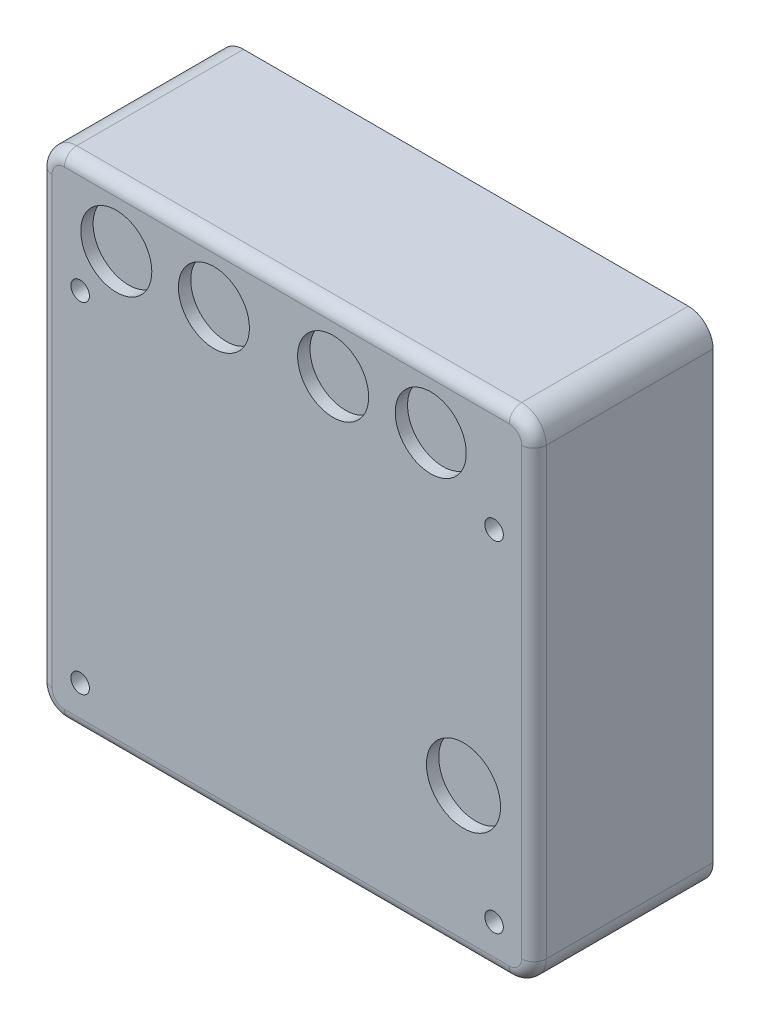
ISO-10303-21;
HEADER;
FILE_DESCRIPTION(('STEP AP214'),'2;1');
FILE_NAME('part.step','',(''),(''),'','','');
FILE_SCHEMA(('AUTOMOTIVE_DESIGN { 1 0 10303 214 1 1 1 1 }'));
ENDSEC;
DATA;
#1=APPLICATION_CONTEXT('core data for automotive mechanical design processes');
#2=APPLICATION_PROTOCOL_DEFINITION('international standard','automotive_design',2000,#1);
#3=PRODUCT_CONTEXT('',#1,'mechanical');
#4=PRODUCT('Part','Part','',(#3));
#5=PRODUCT_RELATED_PRODUCT_CATEGORY('part','',(#4));
#6=PRODUCT_DEFINITION_FORMATION('','',#4);
#7=PRODUCT_DEFINITION_CONTEXT('part definition',#1,'design');
#8=PRODUCT_DEFINITION('design','',#6,#7);
#9=PRODUCT_DEFINITION_SHAPE('','',#8);
#10=(LENGTH_UNIT() NAMED_UNIT(*) SI_UNIT(.MILLI.,.METRE.));
#11=(NAMED_UNIT(*) PLANE_ANGLE_UNIT() SI_UNIT($,.RADIAN.));
#12=(NAMED_UNIT(*) SI_UNIT($,.STERADIAN.) SOLID_ANGLE_UNIT());
#13=UNCERTAINTY_MEASURE_WITH_UNIT(LENGTH_MEASURE(1.E-05),#10,'distance_accuracy_value','');
#14=(GEOMETRIC_REPRESENTATION_CONTEXT(3) GLOBAL_UNCERTAINTY_ASSIGNED_CONTEXT((#13)) GLOBAL_UNIT_ASSIGNED_CONTEXT((#10,
#11,#12)) REPRESENTATION_CONTEXT('',''));
#15=CARTESIAN_POINT('',(0.,0.,0.));
#16=DIRECTION('',(0.,0.,1.));
#17=DIRECTION('',(1.,0.,0.));
#18=AXIS2_PLACEMENT_3D('',#15,#16,#17);
#19=CARTESIAN_POINT('',(0.,0.,14.5));
#20=DIRECTION('',(0.,0.,1.));
#21=DIRECTION('',(1.,0.,0.));
#22=AXIS2_PLACEMENT_3D('',#19,#20,#21);
#23=PLANE('',#22);
#24=CARTESIAN_POINT('',(28.6,-16.4,14.5));
#25=DIRECTION('',(0.,0.,1.));
#26=DIRECTION('',(1.,0.,0.));
#27=AXIS2_PLACEMENT_3D('',#24,#25,#26);
#28=CIRCLE('',#27,6.00000000000001);
#29=CARTESIAN_POINT('',(34.6,-16.4,14.5));
#30=VERTEX_POINT('',#29);
#31=EDGE_CURVE('E630',#30,#30,#28,.T.);
#32=ORIENTED_EDGE('',*,*,#31,.F.);
#33=EDGE_LOOP('',(#32));
#34=FACE_BOUND('',#33,.T.);
#35=CARTESIAN_POINT('',(33.55,21.95,14.5));
#36=DIRECTION('',(0.,0.,1.));
#37=DIRECTION('',(1.,0.,0.));
#38=AXIS2_PLACEMENT_3D('',#35,#36,#37);
#39=CIRCLE('',#38,1.5);
#40=CARTESIAN_POINT('',(35.05,21.95,14.5));
#41=VERTEX_POINT('',#40);
#42=EDGE_CURVE('E648',#41,#41,#39,.T.);
#43=ORIENTED_EDGE('',*,*,#42,.F.);
#44=EDGE_LOOP('',(#43));
#45=FACE_BOUND('',#44,.T.);
#46=CARTESIAN_POINT('',(-33.45,-33.05,14.5));
#47=DIRECTION('',(0.,0.,1.));
#48=DIRECTION('',(1.,0.,0.));
#49=AXIS2_PLACEMENT_3D('',#46,#47,#48);
#50=CIRCLE('',#49,1.5);
#51=CARTESIAN_POINT('',(-31.95,-33.05,14.5));
#52=VERTEX_POINT('',#51);
#53=EDGE_CURVE('E642',#52,#52,#50,.T.);
#54=ORIENTED_EDGE('',*,*,#53,.F.);
#55=EDGE_LOOP('',(#54));
#56=FACE_BOUND('',#55,.T.);
#57=CARTESIAN_POINT('',(33.55,-33.05,14.5));
#58=DIRECTION('',(0.,0.,1.));
#59=DIRECTION('',(1.,0.,0.));
#60=AXIS2_PLACEMENT_3D('',#57,#58,#59);
#61=CIRCLE('',#60,1.5);
#62=CARTESIAN_POINT('',(35.05,-33.05,14.5));
#63=VERTEX_POINT('',#62);
#64=EDGE_CURVE('E629',#63,#63,#61,.T.);
#65=ORIENTED_EDGE('',*,*,#64,.F.);
#66=EDGE_LOOP('',(#65));
#67=FACE_BOUND('',#66,.T.);
#68=CARTESIAN_POINT('',(-33.45,21.95,14.5));
#69=DIRECTION('',(0.,0.,1.));
#70=DIRECTION('',(1.,0.,0.));
#71=AXIS2_PLACEMENT_3D('',#68,#69,#70);
#72=CIRCLE('',#71,1.5);
#73=CARTESIAN_POINT('',(-31.95,21.95,14.5));
#74=VERTEX_POINT('',#73);
#75=EDGE_CURVE('E229',#74,#74,#72,.T.);
#76=ORIENTED_EDGE('',*,*,#75,.F.);
#77=EDGE_LOOP('',(#76));
#78=FACE_BOUND('',#77,.T.);
#79=CARTESIAN_POINT('',(-27.6,30.4,14.5));
#80=DIRECTION('',(0.,0.,1.));
#81=DIRECTION('',(1.,0.,0.));
#82=AXIS2_PLACEMENT_3D('',#79,#80,#81);
#83=CIRCLE('',#82,5.75);
#84=CARTESIAN_POINT('',(-21.85,30.4,14.5));
#85=VERTEX_POINT('',#84);
#86=EDGE_CURVE('E220',#85,#85,#83,.T.);
#87=ORIENTED_EDGE('',*,*,#86,.F.);
#88=EDGE_LOOP('',(#87));
#89=FACE_BOUND('',#88,.T.);
#90=CARTESIAN_POINT('',(-11.8,30.4,14.5));
#91=DIRECTION('',(0.,0.,1.));
#92=DIRECTION('',(1.,0.,0.));
#93=AXIS2_PLACEMENT_3D('',#90,#91,#92);
#94=CIRCLE('',#93,5.75);
#95=CARTESIAN_POINT('',(-6.05000000000002,30.4,14.5));
#96=VERTEX_POINT('',#95);
#97=EDGE_CURVE('E235',#96,#96,#94,.T.);
#98=ORIENTED_EDGE('',*,*,#97,.F.);
#99=EDGE_LOOP('',(#98));
#100=FACE_BOUND('',#99,.T.);
#101=CARTESIAN_POINT('',(7.49999999999998,30.4,14.5));
#102=DIRECTION('',(0.,0.,1.));
#103=DIRECTION('',(1.,0.,0.));
#104=AXIS2_PLACEMENT_3D('',#101,#102,#103);
#105=CIRCLE('',#104,5.75);
#106=CARTESIAN_POINT('',(13.25,30.4,14.5));
#107=VERTEX_POINT('',#106);
#108=EDGE_CURVE('E243',#107,#107,#105,.T.);
#109=ORIENTED_EDGE('',*,*,#108,.F.);
#110=EDGE_LOOP('',(#109));
#111=FACE_BOUND('',#110,.T.);
#112=CARTESIAN_POINT('',(23.3,30.4,14.5));
#113=DIRECTION('',(0.,0.,1.));
#114=DIRECTION('',(1.,0.,0.));
#115=AXIS2_PLACEMENT_3D('',#112,#113,#114);
#116=CIRCLE('',#115,5.75);
#117=CARTESIAN_POINT('',(29.05,30.4,14.5));
#118=VERTEX_POINT('',#117);
#119=EDGE_CURVE('E251',#118,#118,#116,.T.);
#120=ORIENTED_EDGE('',*,*,#119,.F.);
#121=EDGE_LOOP('',(#120));
#122=FACE_BOUND('',#121,.T.);
#123=CARTESIAN_POINT('',(-36.,36.,14.5));
#124=DIRECTION('',(0.,0.,1.));
#125=DIRECTION('',(1.,0.,0.));
#126=AXIS2_PLACEMENT_3D('',#123,#124,#125);
#127=CIRCLE('',#126,2.);
#128=CARTESIAN_POINT('',(-38.,36.,14.5));
#129=VERTEX_POINT('',#128);
#130=CARTESIAN_POINT('',(-36.,38.,14.5));
#131=VERTEX_POINT('',#130);
#132=EDGE_CURVE('E298',#129,#131,#127,.F.);
#133=ORIENTED_EDGE('',*,*,#132,.F.);
#134=DIRECTION('',(0.,-1.,0.));
#135=VECTOR('',#134,1.);
#136=CARTESIAN_POINT('',(-38.,-40.,14.5));
#137=LINE('',#136,#135);
#138=CARTESIAN_POINT('',(-38.,-36.,14.5));
#139=VERTEX_POINT('',#138);
#140=EDGE_CURVE('E138',#129,#139,#137,.T.);
#141=ORIENTED_EDGE('',*,*,#140,.T.);
#142=CARTESIAN_POINT('',(-36.,-36.,14.5));
#143=DIRECTION('',(0.,0.,1.));
#144=DIRECTION('',(1.,0.,0.));
#145=AXIS2_PLACEMENT_3D('',#142,#143,#144);
#146=CIRCLE('',#145,2.);
#147=CARTESIAN_POINT('',(-36.,-38.,14.5));
#148=VERTEX_POINT('',#147);
#149=EDGE_CURVE('E133',#148,#139,#146,.F.);
#150=ORIENTED_EDGE('',*,*,#149,.F.);
#151=DIRECTION('',(1.,0.,0.));
#152=VECTOR('',#151,1.);
#153=CARTESIAN_POINT('',(40.,-38.,14.5));
#154=LINE('',#153,#152);
#155=CARTESIAN_POINT('',(36.,-38.,14.5));
#156=VERTEX_POINT('',#155);
#157=EDGE_CURVE('E136',#148,#156,#154,.T.);
#158=ORIENTED_EDGE('',*,*,#157,.T.);
#159=CARTESIAN_POINT('',(36.,-36.,14.5));
#160=DIRECTION('',(0.,0.,1.));
#161=DIRECTION('',(1.,0.,0.));
#162=AXIS2_PLACEMENT_3D('',#159,#160,#161);
#163=CIRCLE('',#162,2.);
#164=CARTESIAN_POINT('',(38.,-36.,14.5));
#165=VERTEX_POINT('',#164);
#166=EDGE_CURVE('E145',#165,#156,#163,.F.);
#167=ORIENTED_EDGE('',*,*,#166,.F.);
#168=DIRECTION('',(0.,1.,0.));
#169=VECTOR('',#168,1.);
#170=CARTESIAN_POINT('',(38.,40.,14.5));
#171=LINE('',#170,#169);
#172=CARTESIAN_POINT('',(38.,36.,14.5));
#173=VERTEX_POINT('',#172);
#174=EDGE_CURVE('E156',#165,#173,#171,.T.);
#175=ORIENTED_EDGE('',*,*,#174,.T.);
#176=CARTESIAN_POINT('',(36.,36.,14.5));
#177=DIRECTION('',(0.,0.,1.));
#178=DIRECTION('',(1.,0.,0.));
#179=AXIS2_PLACEMENT_3D('',#176,#177,#178);
#180=CIRCLE('',#179,2.);
#181=CARTESIAN_POINT('',(36.,38.,14.5));
#182=VERTEX_POINT('',#181);
#183=EDGE_CURVE('E144',#182,#173,#180,.F.);
#184=ORIENTED_EDGE('',*,*,#183,.F.);
#185=DIRECTION('',(-1.,0.,0.));
#186=VECTOR('',#185,1.);
#187=CARTESIAN_POINT('',(-40.,38.,14.5));
#188=LINE('',#187,#186);
#189=EDGE_CURVE('E270',#182,#131,#188,.T.);
#190=ORIENTED_EDGE('',*,*,#189,.T.);
#191=EDGE_LOOP('',(#133,#141,#150,#158,#167,#175,#184,#190));
#192=FACE_BOUND('',#191,.T.);
#193=ADVANCED_FACE('F41',(#34,#45,#56,#67,#78,#89,#100,#111,#122,#192),#23,.T.);
#194=CARTESIAN_POINT('',(40.,40.,14.5));
#195=DIRECTION('',(-1.,0.,0.));
#196=DIRECTION('',(0.,-1.,0.));
#197=AXIS2_PLACEMENT_3D('',#194,#195,#196);
#198=PLANE('',#197);
#199=DIRECTION('',(0.,1.,0.));
#200=VECTOR('',#199,1.);
#201=CARTESIAN_POINT('',(40.,-40.,12.5));
#202=LINE('',#201,#200);
#203=CARTESIAN_POINT('',(40.,36.,12.5));
#204=VERTEX_POINT('',#203);
#205=CARTESIAN_POINT('',(40.,-36.,12.5));
#206=VERTEX_POINT('',#205);
#207=EDGE_CURVE('E279',#204,#206,#202,.F.);
#208=ORIENTED_EDGE('',*,*,#207,.T.);
#209=DIRECTION('',(0.,0.,-1.));
#210=VECTOR('',#209,1.);
#211=CARTESIAN_POINT('',(40.,-36.,14.5));
#212=LINE('',#211,#210);
#213=CARTESIAN_POINT('',(40.,-36.,-14.5));
#214=VERTEX_POINT('',#213);
#215=EDGE_CURVE('E175',#206,#214,#212,.T.);
#216=ORIENTED_EDGE('',*,*,#215,.T.);
#217=DIRECTION('',(0.,1.,0.));
#218=VECTOR('',#217,1.);
#219=CARTESIAN_POINT('',(40.,40.,-14.5));
#220=LINE('',#219,#218);
#221=CARTESIAN_POINT('',(40.,36.,-14.5));
#222=VERTEX_POINT('',#221);
#223=EDGE_CURVE('E207',#214,#222,#220,.T.);
#224=ORIENTED_EDGE('',*,*,#223,.T.);
#225=DIRECTION('',(0.,0.,-1.));
#226=VECTOR('',#225,1.);
#227=CARTESIAN_POINT('',(40.,36.,14.5));
#228=LINE('',#227,#226);
#229=EDGE_CURVE('E167',#222,#204,#228,.F.);
#230=ORIENTED_EDGE('',*,*,#229,.T.);
#231=EDGE_LOOP('',(#208,#216,#224,#230));
#232=FACE_BOUND('',#231,.T.);
#233=ADVANCED_FACE('F347',(#232),#198,.F.);
#234=CARTESIAN_POINT('',(-40.,40.,14.5));
#235=DIRECTION('',(0.,-1.,0.));
#236=DIRECTION('',(0.,0.,-1.));
#237=AXIS2_PLACEMENT_3D('',#234,#235,#236);
#238=PLANE('',#237);
#239=DIRECTION('',(-1.,0.,0.));
#240=VECTOR('',#239,1.);
#241=CARTESIAN_POINT('',(40.,40.,12.5));
#242=LINE('',#241,#240);
#243=CARTESIAN_POINT('',(-36.,40.,12.5));
#244=VERTEX_POINT('',#243);
#245=CARTESIAN_POINT('',(36.,40.,12.5));
#246=VERTEX_POINT('',#245);
#247=EDGE_CURVE('E290',#244,#246,#242,.F.);
#248=ORIENTED_EDGE('',*,*,#247,.T.);
#249=DIRECTION('',(0.,0.,-1.));
#250=VECTOR('',#249,1.);
#251=CARTESIAN_POINT('',(36.,40.,14.5));
#252=LINE('',#251,#250);
#253=CARTESIAN_POINT('',(36.,40.,-14.5));
#254=VERTEX_POINT('',#253);
#255=EDGE_CURVE('E11',#246,#254,#252,.T.);
#256=ORIENTED_EDGE('',*,*,#255,.T.);
#257=DIRECTION('',(-1.,0.,0.));
#258=VECTOR('',#257,1.);
#259=CARTESIAN_POINT('',(-40.,40.,-14.5));
#260=LINE('',#259,#258);
#261=CARTESIAN_POINT('',(-36.,40.,-14.5));
#262=VERTEX_POINT('',#261);
#263=EDGE_CURVE('E259',#254,#262,#260,.T.);
#264=ORIENTED_EDGE('',*,*,#263,.T.);
#265=DIRECTION('',(0.,0.,-1.));
#266=VECTOR('',#265,1.);
#267=CARTESIAN_POINT('',(-36.,40.,14.5));
#268=LINE('',#267,#266);
#269=EDGE_CURVE('E51',#262,#244,#268,.F.);
#270=ORIENTED_EDGE('',*,*,#269,.T.);
#271=EDGE_LOOP('',(#248,#256,#264,#270));
#272=FACE_BOUND('',#271,.T.);
#273=ADVANCED_FACE('F338',(#272),#238,.F.);
#274=CARTESIAN_POINT('',(-40.,40.,14.5));
#275=DIRECTION('',(1.,0.,0.));
#276=DIRECTION('',(0.,0.,-1.));
#277=AXIS2_PLACEMENT_3D('',#274,#275,#276);
#278=PLANE('',#277);
#279=DIRECTION('',(0.,-1.,0.));
#280=VECTOR('',#279,1.);
#281=CARTESIAN_POINT('',(-40.,40.,-14.5));
#282=LINE('',#281,#280);
#283=CARTESIAN_POINT('',(-40.,36.,-14.5));
#284=VERTEX_POINT('',#283);
#285=CARTESIAN_POINT('',(-40.,-36.,-14.5));
#286=VERTEX_POINT('',#285);
#287=EDGE_CURVE('E262',#284,#286,#282,.T.);
#288=ORIENTED_EDGE('',*,*,#287,.T.);
#289=DIRECTION('',(0.,0.,-1.));
#290=VECTOR('',#289,1.);
#291=CARTESIAN_POINT('',(-40.,-36.,14.5));
#292=LINE('',#291,#290);
#293=CARTESIAN_POINT('',(-40.,-36.,12.5));
#294=VERTEX_POINT('',#293);
#295=EDGE_CURVE('E198',#286,#294,#292,.F.);
#296=ORIENTED_EDGE('',*,*,#295,.T.);
#297=DIRECTION('',(0.,-1.,0.));
#298=VECTOR('',#297,1.);
#299=CARTESIAN_POINT('',(-40.,40.,12.5));
#300=LINE('',#299,#298);
#301=CARTESIAN_POINT('',(-40.,36.,12.5));
#302=VERTEX_POINT('',#301);
#303=EDGE_CURVE('E286',#294,#302,#300,.F.);
#304=ORIENTED_EDGE('',*,*,#303,.T.);
#305=DIRECTION('',(0.,0.,-1.));
#306=VECTOR('',#305,1.);
#307=CARTESIAN_POINT('',(-40.,36.,14.5));
#308=LINE('',#307,#306);
#309=EDGE_CURVE('E195',#302,#284,#308,.T.);
#310=ORIENTED_EDGE('',*,*,#309,.T.);
#311=EDGE_LOOP('',(#288,#296,#304,#310));
#312=FACE_BOUND('',#311,.T.);
#313=ADVANCED_FACE('F320',(#312),#278,.F.);
#314=CARTESIAN_POINT('',(-40.,-40.,14.5));
#315=DIRECTION('',(0.,1.,0.));
#316=DIRECTION('',(0.,0.,1.));
#317=AXIS2_PLACEMENT_3D('',#314,#315,#316);
#318=PLANE('',#317);
#319=DIRECTION('',(1.,0.,0.));
#320=VECTOR('',#319,1.);
#321=CARTESIAN_POINT('',(-40.,-40.,-14.5));
#322=LINE('',#321,#320);
#323=CARTESIAN_POINT('',(-36.,-40.,-14.5));
#324=VERTEX_POINT('',#323);
#325=CARTESIAN_POINT('',(36.,-40.,-14.5));
#326=VERTEX_POINT('',#325);
#327=EDGE_CURVE('E266',#324,#326,#322,.T.);
#328=ORIENTED_EDGE('',*,*,#327,.T.);
#329=DIRECTION('',(0.,0.,-1.));
#330=VECTOR('',#329,1.);
#331=CARTESIAN_POINT('',(36.,-40.,14.5));
#332=LINE('',#331,#330);
#333=CARTESIAN_POINT('',(36.,-40.,12.5));
#334=VERTEX_POINT('',#333);
#335=EDGE_CURVE('E192',#326,#334,#332,.F.);
#336=ORIENTED_EDGE('',*,*,#335,.T.);
#337=DIRECTION('',(1.,0.,0.));
#338=VECTOR('',#337,1.);
#339=CARTESIAN_POINT('',(-40.,-40.,12.5));
#340=LINE('',#339,#338);
#341=CARTESIAN_POINT('',(-36.,-40.,12.5));
#342=VERTEX_POINT('',#341);
#343=EDGE_CURVE('E283',#334,#342,#340,.F.);
#344=ORIENTED_EDGE('',*,*,#343,.T.);
#345=DIRECTION('',(0.,0.,-1.));
#346=VECTOR('',#345,1.);
#347=CARTESIAN_POINT('',(-36.,-40.,14.5));
#348=LINE('',#347,#346);
#349=EDGE_CURVE('E189',#342,#324,#348,.T.);
#350=ORIENTED_EDGE('',*,*,#349,.T.);
#351=EDGE_LOOP('',(#328,#336,#344,#350));
#352=FACE_BOUND('',#351,.T.);
#353=ADVANCED_FACE('F355',(#352),#318,.F.);
#354=CARTESIAN_POINT('',(0.,0.,-14.5));
#355=DIRECTION('',(0.,0.,1.));
#356=DIRECTION('',(1.,0.,0.));
#357=AXIS2_PLACEMENT_3D('',#354,#355,#356);
#358=PLANE('',#357);
#359=ORIENTED_EDGE('',*,*,#223,.F.);
#360=CARTESIAN_POINT('',(36.,-36.,-14.5));
#361=DIRECTION('',(0.,0.,1.));
#362=DIRECTION('',(1.,0.,0.));
#363=AXIS2_PLACEMENT_3D('',#360,#361,#362);
#364=CIRCLE('',#363,4.);
#365=EDGE_CURVE('E186',#214,#326,#364,.F.);
#366=ORIENTED_EDGE('',*,*,#365,.T.);
#367=ORIENTED_EDGE('',*,*,#327,.F.);
#368=CARTESIAN_POINT('',(-36.,-36.,-14.5));
#369=DIRECTION('',(0.,0.,1.));
#370=DIRECTION('',(1.,0.,0.));
#371=AXIS2_PLACEMENT_3D('',#368,#369,#370);
#372=CIRCLE('',#371,4.);
#373=EDGE_CURVE('E183',#324,#286,#372,.F.);
#374=ORIENTED_EDGE('',*,*,#373,.T.);
#375=ORIENTED_EDGE('',*,*,#287,.F.);
#376=CARTESIAN_POINT('',(-36.,36.,-14.5));
#377=DIRECTION('',(0.,0.,1.));
#378=DIRECTION('',(1.,0.,0.));
#379=AXIS2_PLACEMENT_3D('',#376,#377,#378);
#380=CIRCLE('',#379,4.);
#381=EDGE_CURVE('E59',#284,#262,#380,.F.);
#382=ORIENTED_EDGE('',*,*,#381,.T.);
#383=ORIENTED_EDGE('',*,*,#263,.F.);
#384=CARTESIAN_POINT('',(36.,36.,-14.5));
#385=DIRECTION('',(0.,0.,1.));
#386=DIRECTION('',(1.,0.,0.));
#387=AXIS2_PLACEMENT_3D('',#384,#385,#386);
#388=CIRCLE('',#387,4.);
#389=EDGE_CURVE('E180',#254,#222,#388,.F.);
#390=ORIENTED_EDGE('',*,*,#389,.T.);
#391=EDGE_LOOP('',(#359,#366,#367,#374,#375,#382,#383,#390));
#392=FACE_BOUND('',#391,.T.);
#393=ADVANCED_FACE('F344',(#392),#358,.F.);
#394=CARTESIAN_POINT('',(-38.,0.,12.5));
#395=DIRECTION('',(0.,1.,0.));
#396=DIRECTION('',(0.,0.,1.));
#397=AXIS2_PLACEMENT_3D('',#394,#395,#396);
#398=CYLINDRICAL_SURFACE('',#397,2.);
#399=ORIENTED_EDGE('',*,*,#303,.F.);
#400=CARTESIAN_POINT('',(-38.,-36.,12.5));
#401=DIRECTION('',(0.,1.,0.));
#402=DIRECTION('',(0.,0.,1.));
#403=AXIS2_PLACEMENT_3D('',#400,#401,#402);
#404=CIRCLE('',#403,2.);
#405=EDGE_CURVE('E163',#294,#139,#404,.T.);
#406=ORIENTED_EDGE('',*,*,#405,.T.);
#407=ORIENTED_EDGE('',*,*,#140,.F.);
#408=CARTESIAN_POINT('',(-38.,36.,12.5));
#409=DIRECTION('',(0.,-1.,0.));
#410=DIRECTION('',(0.,0.,-1.));
#411=AXIS2_PLACEMENT_3D('',#408,#409,#410);
#412=CIRCLE('',#411,2.);
#413=EDGE_CURVE('E169',#129,#302,#412,.T.);
#414=ORIENTED_EDGE('',*,*,#413,.T.);
#415=EDGE_LOOP('',(#399,#406,#407,#414));
#416=FACE_BOUND('',#415,.T.);
#417=ADVANCED_FACE('F316',(#416),#398,.T.);
#418=CARTESIAN_POINT('',(0.,-38.,12.5));
#419=DIRECTION('',(-1.,0.,0.));
#420=DIRECTION('',(0.,0.,1.));
#421=AXIS2_PLACEMENT_3D('',#418,#419,#420);
#422=CYLINDRICAL_SURFACE('',#421,2.);
#423=ORIENTED_EDGE('',*,*,#343,.F.);
#424=CARTESIAN_POINT('',(36.,-38.,12.5));
#425=DIRECTION('',(-1.,0.,0.));
#426=DIRECTION('',(0.,0.,1.));
#427=AXIS2_PLACEMENT_3D('',#424,#425,#426);
#428=CIRCLE('',#427,2.);
#429=EDGE_CURVE('E154',#334,#156,#428,.T.);
#430=ORIENTED_EDGE('',*,*,#429,.T.);
#431=ORIENTED_EDGE('',*,*,#157,.F.);
#432=CARTESIAN_POINT('',(-36.,-38.,12.5));
#433=DIRECTION('',(1.,0.,0.));
#434=DIRECTION('',(0.,0.,-1.));
#435=AXIS2_PLACEMENT_3D('',#432,#433,#434);
#436=CIRCLE('',#435,2.);
#437=EDGE_CURVE('E151',#148,#342,#436,.T.);
#438=ORIENTED_EDGE('',*,*,#437,.T.);
#439=EDGE_LOOP('',(#423,#430,#431,#438));
#440=FACE_BOUND('',#439,.T.);
#441=ADVANCED_FACE('F150',(#440),#422,.T.);
#442=CARTESIAN_POINT('',(0.,38.,12.5));
#443=DIRECTION('',(1.,0.,0.));
#444=DIRECTION('',(0.,0.,-1.));
#445=AXIS2_PLACEMENT_3D('',#442,#443,#444);
#446=CYLINDRICAL_SURFACE('',#445,2.);
#447=ORIENTED_EDGE('',*,*,#247,.F.);
#448=CARTESIAN_POINT('',(-36.,38.,12.5));
#449=DIRECTION('',(1.,0.,0.));
#450=DIRECTION('',(0.,0.,-1.));
#451=AXIS2_PLACEMENT_3D('',#448,#449,#450);
#452=CIRCLE('',#451,2.);
#453=EDGE_CURVE('E305',#244,#131,#452,.T.);
#454=ORIENTED_EDGE('',*,*,#453,.T.);
#455=ORIENTED_EDGE('',*,*,#189,.F.);
#456=CARTESIAN_POINT('',(36.,38.,12.5));
#457=DIRECTION('',(-1.,0.,0.));
#458=DIRECTION('',(0.,0.,1.));
#459=AXIS2_PLACEMENT_3D('',#456,#457,#458);
#460=CIRCLE('',#459,2.);
#461=EDGE_CURVE('E302',#182,#246,#460,.T.);
#462=ORIENTED_EDGE('',*,*,#461,.T.);
#463=EDGE_LOOP('',(#447,#454,#455,#462));
#464=FACE_BOUND('',#463,.T.);
#465=ADVANCED_FACE('F331',(#464),#446,.T.);
#466=CARTESIAN_POINT('',(38.,0.,12.5));
#467=DIRECTION('',(0.,-1.,0.));
#468=DIRECTION('',(1.,0.,0.));
#469=AXIS2_PLACEMENT_3D('',#466,#467,#468);
#470=CYLINDRICAL_SURFACE('',#469,2.);
#471=ORIENTED_EDGE('',*,*,#207,.F.);
#472=CARTESIAN_POINT('',(38.,36.,12.5));
#473=DIRECTION('',(0.,-1.,0.));
#474=DIRECTION('',(0.,0.,-1.));
#475=AXIS2_PLACEMENT_3D('',#472,#473,#474);
#476=CIRCLE('',#475,2.);
#477=EDGE_CURVE('E311',#204,#173,#476,.T.);
#478=ORIENTED_EDGE('',*,*,#477,.T.);
#479=ORIENTED_EDGE('',*,*,#174,.F.);
#480=CARTESIAN_POINT('',(38.,-36.,12.5));
#481=DIRECTION('',(0.,1.,0.));
#482=DIRECTION('',(0.,0.,1.));
#483=AXIS2_PLACEMENT_3D('',#480,#481,#482);
#484=CIRCLE('',#483,2.);
#485=EDGE_CURVE('E308',#165,#206,#484,.T.);
#486=ORIENTED_EDGE('',*,*,#485,.T.);
#487=EDGE_LOOP('',(#471,#478,#479,#486));
#488=FACE_BOUND('',#487,.T.);
#489=ADVANCED_FACE('F388',(#488),#470,.T.);
#490=CARTESIAN_POINT('',(-36.,36.,14.5));
#491=DIRECTION('',(0.,0.,-1.));
#492=DIRECTION('',(-1.,0.,0.));
#493=AXIS2_PLACEMENT_3D('',#490,#491,#492);
#494=CYLINDRICAL_SURFACE('',#493,4.);
#495=ORIENTED_EDGE('',*,*,#381,.F.);
#496=ORIENTED_EDGE('',*,*,#309,.F.);
#497=CARTESIAN_POINT('',(-36.,36.,12.5));
#498=DIRECTION('',(0.,0.,1.));
#499=DIRECTION('',(1.,0.,0.));
#500=AXIS2_PLACEMENT_3D('',#497,#498,#499);
#501=CIRCLE('',#500,4.);
#502=EDGE_CURVE('E203',#244,#302,#501,.T.);
#503=ORIENTED_EDGE('',*,*,#502,.F.);
#504=ORIENTED_EDGE('',*,*,#269,.F.);
#505=EDGE_LOOP('',(#495,#496,#503,#504));
#506=FACE_BOUND('',#505,.T.);
#507=ADVANCED_FACE('F324',(#506),#494,.T.);
#508=CARTESIAN_POINT('',(-36.,36.,12.5));
#509=DIRECTION('',(0.,0.,1.));
#510=DIRECTION('',(1.,0.,0.));
#511=AXIS2_PLACEMENT_3D('',#508,#509,#510);
#512=DEGENERATE_TOROIDAL_SURFACE('',#511,2.,2.,.T.);
#513=ORIENTED_EDGE('',*,*,#413,.F.);
#514=ORIENTED_EDGE('',*,*,#132,.T.);
#515=ORIENTED_EDGE('',*,*,#453,.F.);
#516=ORIENTED_EDGE('',*,*,#502,.T.);
#517=EDGE_LOOP('',(#513,#514,#515,#516));
#518=FACE_BOUND('',#517,.T.);
#519=ADVANCED_FACE('F327',(#518),#512,.T.);
#520=CARTESIAN_POINT('',(36.,36.,14.5));
#521=DIRECTION('',(0.,0.,-1.));
#522=DIRECTION('',(-1.,0.,0.));
#523=AXIS2_PLACEMENT_3D('',#520,#521,#522);
#524=CYLINDRICAL_SURFACE('',#523,4.);
#525=ORIENTED_EDGE('',*,*,#389,.F.);
#526=ORIENTED_EDGE('',*,*,#255,.F.);
#527=CARTESIAN_POINT('',(36.,36.,12.5));
#528=DIRECTION('',(0.,0.,1.));
#529=DIRECTION('',(1.,0.,0.));
#530=AXIS2_PLACEMENT_3D('',#527,#528,#529);
#531=CIRCLE('',#530,4.);
#532=EDGE_CURVE('E208',#204,#246,#531,.T.);
#533=ORIENTED_EDGE('',*,*,#532,.F.);
#534=ORIENTED_EDGE('',*,*,#229,.F.);
#535=EDGE_LOOP('',(#525,#526,#533,#534));
#536=FACE_BOUND('',#535,.T.);
#537=ADVANCED_FACE('F341',(#536),#524,.T.);
#538=CARTESIAN_POINT('',(36.,36.,12.5));
#539=DIRECTION('',(0.,0.,1.));
#540=DIRECTION('',(1.,0.,0.));
#541=AXIS2_PLACEMENT_3D('',#538,#539,#540);
#542=DEGENERATE_TOROIDAL_SURFACE('',#541,2.,2.,.T.);
#543=ORIENTED_EDGE('',*,*,#461,.F.);
#544=ORIENTED_EDGE('',*,*,#183,.T.);
#545=ORIENTED_EDGE('',*,*,#477,.F.);
#546=ORIENTED_EDGE('',*,*,#532,.T.);
#547=EDGE_LOOP('',(#543,#544,#545,#546));
#548=FACE_BOUND('',#547,.T.);
#549=ADVANCED_FACE('F336',(#548),#542,.T.);
#550=CARTESIAN_POINT('',(-36.,-36.,14.5));
#551=DIRECTION('',(0.,0.,-1.));
#552=DIRECTION('',(-1.,0.,0.));
#553=AXIS2_PLACEMENT_3D('',#550,#551,#552);
#554=CYLINDRICAL_SURFACE('',#553,4.);
#555=ORIENTED_EDGE('',*,*,#373,.F.);
#556=ORIENTED_EDGE('',*,*,#349,.F.);
#557=CARTESIAN_POINT('',(-36.,-36.,12.5));
#558=DIRECTION('',(0.,0.,1.));
#559=DIRECTION('',(1.,0.,0.));
#560=AXIS2_PLACEMENT_3D('',#557,#558,#559);
#561=CIRCLE('',#560,4.);
#562=EDGE_CURVE('E161',#294,#342,#561,.T.);
#563=ORIENTED_EDGE('',*,*,#562,.F.);
#564=ORIENTED_EDGE('',*,*,#295,.F.);
#565=EDGE_LOOP('',(#555,#556,#563,#564));
#566=FACE_BOUND('',#565,.T.);
#567=ADVANCED_FACE('F358',(#566),#554,.T.);
#568=CARTESIAN_POINT('',(-36.,-36.,12.5));
#569=DIRECTION('',(0.,0.,1.));
#570=DIRECTION('',(1.,0.,0.));
#571=AXIS2_PLACEMENT_3D('',#568,#569,#570);
#572=DEGENERATE_TOROIDAL_SURFACE('',#571,2.,2.,.T.);
#573=ORIENTED_EDGE('',*,*,#405,.F.);
#574=ORIENTED_EDGE('',*,*,#562,.T.);
#575=ORIENTED_EDGE('',*,*,#437,.F.);
#576=ORIENTED_EDGE('',*,*,#149,.T.);
#577=EDGE_LOOP('',(#573,#574,#575,#576));
#578=FACE_BOUND('',#577,.T.);
#579=ADVANCED_FACE('F159',(#578),#572,.T.);
#580=CARTESIAN_POINT('',(36.,-36.,14.5));
#581=DIRECTION('',(0.,0.,-1.));
#582=DIRECTION('',(-1.,0.,0.));
#583=AXIS2_PLACEMENT_3D('',#580,#581,#582);
#584=CYLINDRICAL_SURFACE('',#583,4.);
#585=ORIENTED_EDGE('',*,*,#365,.F.);
#586=ORIENTED_EDGE('',*,*,#215,.F.);
#587=CARTESIAN_POINT('',(36.,-36.,12.5));
#588=DIRECTION('',(0.,0.,1.));
#589=DIRECTION('',(1.,0.,0.));
#590=AXIS2_PLACEMENT_3D('',#587,#588,#589);
#591=CIRCLE('',#590,4.);
#592=EDGE_CURVE('E45',#334,#206,#591,.T.);
#593=ORIENTED_EDGE('',*,*,#592,.F.);
#594=ORIENTED_EDGE('',*,*,#335,.F.);
#595=EDGE_LOOP('',(#585,#586,#593,#594));
#596=FACE_BOUND('',#595,.T.);
#597=ADVANCED_FACE('F43',(#596),#584,.T.);
#598=CARTESIAN_POINT('',(36.,-36.,12.5));
#599=DIRECTION('',(0.,0.,1.));
#600=DIRECTION('',(1.,0.,0.));
#601=AXIS2_PLACEMENT_3D('',#598,#599,#600);
#602=DEGENERATE_TOROIDAL_SURFACE('',#601,2.,2.,.T.);
#603=ORIENTED_EDGE('',*,*,#429,.F.);
#604=ORIENTED_EDGE('',*,*,#592,.T.);
#605=ORIENTED_EDGE('',*,*,#485,.F.);
#606=ORIENTED_EDGE('',*,*,#166,.T.);
#607=EDGE_LOOP('',(#603,#604,#605,#606));
#608=FACE_BOUND('',#607,.T.);
#609=ADVANCED_FACE('F432',(#608),#602,.T.);
#610=CARTESIAN_POINT('',(23.3,30.4,12.5));
#611=DIRECTION('',(0.,0.,1.));
#612=DIRECTION('',(1.,0.,0.));
#613=AXIS2_PLACEMENT_3D('',#610,#611,#612);
#614=CYLINDRICAL_SURFACE('',#613,5.75);
#615=CARTESIAN_POINT('',(23.3,30.4,12.5));
#616=DIRECTION('',(0.,0.,1.));
#617=DIRECTION('',(1.,0.,0.));
#618=AXIS2_PLACEMENT_3D('',#615,#616,#617);
#619=CIRCLE('',#618,5.75);
#620=CARTESIAN_POINT('',(29.05,30.4,12.5));
#621=VERTEX_POINT('',#620);
#622=EDGE_CURVE('E247',#621,#621,#619,.T.);
#623=ORIENTED_EDGE('',*,*,#622,.F.);
#624=EDGE_LOOP('',(#623));
#625=FACE_BOUND('',#624,.T.);
#626=ORIENTED_EDGE('',*,*,#119,.T.);
#627=EDGE_LOOP('',(#626));
#628=FACE_BOUND('',#627,.T.);
#629=ADVANCED_FACE('F378',(#625,#628),#614,.F.);
#630=CARTESIAN_POINT('',(23.3,30.4,12.5));
#631=DIRECTION('',(0.,0.,1.));
#632=DIRECTION('',(1.,0.,0.));
#633=AXIS2_PLACEMENT_3D('',#630,#631,#632);
#634=PLANE('',#633);
#635=ORIENTED_EDGE('',*,*,#622,.T.);
#636=EDGE_LOOP('',(#635));
#637=FACE_BOUND('',#636,.T.);
#638=ADVANCED_FACE('F448',(#637),#634,.T.);
#639=CARTESIAN_POINT('',(7.49999999999998,30.4,12.5));
#640=DIRECTION('',(0.,0.,1.));
#641=DIRECTION('',(1.,0.,0.));
#642=AXIS2_PLACEMENT_3D('',#639,#640,#641);
#643=CYLINDRICAL_SURFACE('',#642,5.75);
#644=CARTESIAN_POINT('',(7.49999999999998,30.4,12.5));
#645=DIRECTION('',(0.,0.,1.));
#646=DIRECTION('',(1.,0.,0.));
#647=AXIS2_PLACEMENT_3D('',#644,#645,#646);
#648=CIRCLE('',#647,5.75);
#649=CARTESIAN_POINT('',(13.25,30.4,12.5));
#650=VERTEX_POINT('',#649);
#651=EDGE_CURVE('E239',#650,#650,#648,.T.);
#652=ORIENTED_EDGE('',*,*,#651,.F.);
#653=EDGE_LOOP('',(#652));
#654=FACE_BOUND('',#653,.T.);
#655=ORIENTED_EDGE('',*,*,#108,.T.);
#656=EDGE_LOOP('',(#655));
#657=FACE_BOUND('',#656,.T.);
#658=ADVANCED_FACE('F457',(#654,#657),#643,.F.);
#659=CARTESIAN_POINT('',(7.49999999999998,30.4,12.5));
#660=DIRECTION('',(0.,0.,1.));
#661=DIRECTION('',(1.,0.,0.));
#662=AXIS2_PLACEMENT_3D('',#659,#660,#661);
#663=PLANE('',#662);
#664=ORIENTED_EDGE('',*,*,#651,.T.);
#665=EDGE_LOOP('',(#664));
#666=FACE_BOUND('',#665,.T.);
#667=ADVANCED_FACE('F466',(#666),#663,.T.);
#668=CARTESIAN_POINT('',(-11.8,30.4,12.5));
#669=DIRECTION('',(0.,0.,1.));
#670=DIRECTION('',(1.,0.,0.));
#671=AXIS2_PLACEMENT_3D('',#668,#669,#670);
#672=CYLINDRICAL_SURFACE('',#671,5.75);
#673=CARTESIAN_POINT('',(-11.8,30.4,12.5));
#674=DIRECTION('',(0.,0.,1.));
#675=DIRECTION('',(1.,0.,0.));
#676=AXIS2_PLACEMENT_3D('',#673,#674,#675);
#677=CIRCLE('',#676,5.75);
#678=CARTESIAN_POINT('',(-6.05000000000002,30.4,12.5));
#679=VERTEX_POINT('',#678);
#680=EDGE_CURVE('E226',#679,#679,#677,.T.);
#681=ORIENTED_EDGE('',*,*,#680,.F.);
#682=EDGE_LOOP('',(#681));
#683=FACE_BOUND('',#682,.T.);
#684=ORIENTED_EDGE('',*,*,#97,.T.);
#685=EDGE_LOOP('',(#684));
#686=FACE_BOUND('',#685,.T.);
#687=ADVANCED_FACE('F476',(#683,#686),#672,.F.);
#688=CARTESIAN_POINT('',(-11.8,30.4,12.5));
#689=DIRECTION('',(0.,0.,1.));
#690=DIRECTION('',(1.,0.,0.));
#691=AXIS2_PLACEMENT_3D('',#688,#689,#690);
#692=PLANE('',#691);
#693=ORIENTED_EDGE('',*,*,#680,.T.);
#694=EDGE_LOOP('',(#693));
#695=FACE_BOUND('',#694,.T.);
#696=ADVANCED_FACE('F486',(#695),#692,.T.);
#697=CARTESIAN_POINT('',(-27.6,30.4,12.5));
#698=DIRECTION('',(0.,0.,1.));
#699=DIRECTION('',(1.,0.,0.));
#700=AXIS2_PLACEMENT_3D('',#697,#698,#699);
#701=CYLINDRICAL_SURFACE('',#700,5.75);
#702=CARTESIAN_POINT('',(-27.6,30.4,12.5));
#703=DIRECTION('',(0.,0.,1.));
#704=DIRECTION('',(1.,0.,0.));
#705=AXIS2_PLACEMENT_3D('',#702,#703,#704);
#706=CIRCLE('',#705,5.75);
#707=CARTESIAN_POINT('',(-21.85,30.4,12.5));
#708=VERTEX_POINT('',#707);
#709=EDGE_CURVE('E214',#708,#708,#706,.T.);
#710=ORIENTED_EDGE('',*,*,#709,.F.);
#711=EDGE_LOOP('',(#710));
#712=FACE_BOUND('',#711,.T.);
#713=ORIENTED_EDGE('',*,*,#86,.T.);
#714=EDGE_LOOP('',(#713));
#715=FACE_BOUND('',#714,.T.);
#716=ADVANCED_FACE('F496',(#712,#715),#701,.F.);
#717=CARTESIAN_POINT('',(-27.6,30.4,12.5));
#718=DIRECTION('',(0.,0.,1.));
#719=DIRECTION('',(1.,0.,0.));
#720=AXIS2_PLACEMENT_3D('',#717,#718,#719);
#721=PLANE('',#720);
#722=ORIENTED_EDGE('',*,*,#709,.T.);
#723=EDGE_LOOP('',(#722));
#724=FACE_BOUND('',#723,.T.);
#725=ADVANCED_FACE('F506',(#724),#721,.T.);
#726=CARTESIAN_POINT('',(-33.45,21.95,2.5));
#727=DIRECTION('',(0.,0.,1.));
#728=DIRECTION('',(1.,0.,0.));
#729=AXIS2_PLACEMENT_3D('',#726,#727,#728);
#730=CYLINDRICAL_SURFACE('',#729,1.5);
#731=CARTESIAN_POINT('',(-33.45,21.95,2.5));
#732=DIRECTION('',(0.,0.,1.));
#733=DIRECTION('',(1.,0.,0.));
#734=AXIS2_PLACEMENT_3D('',#731,#732,#733);
#735=CIRCLE('',#734,1.5);
#736=CARTESIAN_POINT('',(-31.95,21.95,2.5));
#737=VERTEX_POINT('',#736);
#738=EDGE_CURVE('E255',#737,#737,#735,.T.);
#739=ORIENTED_EDGE('',*,*,#738,.F.);
#740=EDGE_LOOP('',(#739));
#741=FACE_BOUND('',#740,.T.);
#742=ORIENTED_EDGE('',*,*,#75,.T.);
#743=EDGE_LOOP('',(#742));
#744=FACE_BOUND('',#743,.T.);
#745=ADVANCED_FACE('F516',(#741,#744),#730,.F.);
#746=CARTESIAN_POINT('',(-33.45,21.95,2.5));
#747=DIRECTION('',(0.,0.,1.));
#748=DIRECTION('',(1.,0.,0.));
#749=AXIS2_PLACEMENT_3D('',#746,#747,#748);
#750=PLANE('',#749);
#751=ORIENTED_EDGE('',*,*,#738,.T.);
#752=EDGE_LOOP('',(#751));
#753=FACE_BOUND('',#752,.T.);
#754=ADVANCED_FACE('F525',(#753),#750,.T.);
#755=CARTESIAN_POINT('',(33.55,-33.05,2.5));
#756=DIRECTION('',(0.,0.,1.));
#757=DIRECTION('',(1.,0.,0.));
#758=AXIS2_PLACEMENT_3D('',#755,#756,#757);
#759=CYLINDRICAL_SURFACE('',#758,1.5);
#760=CARTESIAN_POINT('',(33.55,-33.05,2.5));
#761=DIRECTION('',(0.,0.,1.));
#762=DIRECTION('',(1.,0.,0.));
#763=AXIS2_PLACEMENT_3D('',#760,#761,#762);
#764=CIRCLE('',#763,1.5);
#765=CARTESIAN_POINT('',(35.05,-33.05,2.5));
#766=VERTEX_POINT('',#765);
#767=EDGE_CURVE('E635',#766,#766,#764,.T.);
#768=ORIENTED_EDGE('',*,*,#767,.F.);
#769=EDGE_LOOP('',(#768));
#770=FACE_BOUND('',#769,.T.);
#771=ORIENTED_EDGE('',*,*,#64,.T.);
#772=EDGE_LOOP('',(#771));
#773=FACE_BOUND('',#772,.T.);
#774=ADVANCED_FACE('F535',(#770,#773),#759,.F.);
#775=CARTESIAN_POINT('',(33.55,-33.05,2.5));
#776=DIRECTION('',(0.,0.,1.));
#777=DIRECTION('',(1.,0.,0.));
#778=AXIS2_PLACEMENT_3D('',#775,#776,#777);
#779=PLANE('',#778);
#780=ORIENTED_EDGE('',*,*,#767,.T.);
#781=EDGE_LOOP('',(#780));
#782=FACE_BOUND('',#781,.T.);
#783=ADVANCED_FACE('F545',(#782),#779,.T.);
#784=CARTESIAN_POINT('',(-33.45,-33.05,2.5));
#785=DIRECTION('',(0.,0.,1.));
#786=DIRECTION('',(1.,0.,0.));
#787=AXIS2_PLACEMENT_3D('',#784,#785,#786);
#788=CYLINDRICAL_SURFACE('',#787,1.5);
#789=CARTESIAN_POINT('',(-33.45,-33.05,2.5));
#790=DIRECTION('',(0.,0.,1.));
#791=DIRECTION('',(1.,0.,0.));
#792=AXIS2_PLACEMENT_3D('',#789,#790,#791);
#793=CIRCLE('',#792,1.5);
#794=CARTESIAN_POINT('',(-31.95,-33.05,2.5));
#795=VERTEX_POINT('',#794);
#796=EDGE_CURVE('E652',#795,#795,#793,.T.);
#797=ORIENTED_EDGE('',*,*,#796,.F.);
#798=EDGE_LOOP('',(#797));
#799=FACE_BOUND('',#798,.T.);
#800=ORIENTED_EDGE('',*,*,#53,.T.);
#801=EDGE_LOOP('',(#800));
#802=FACE_BOUND('',#801,.T.);
#803=ADVANCED_FACE('F555',(#799,#802),#788,.F.);
#804=CARTESIAN_POINT('',(-33.45,-33.05,2.5));
#805=DIRECTION('',(0.,0.,1.));
#806=DIRECTION('',(1.,0.,0.));
#807=AXIS2_PLACEMENT_3D('',#804,#805,#806);
#808=PLANE('',#807);
#809=ORIENTED_EDGE('',*,*,#796,.T.);
#810=EDGE_LOOP('',(#809));
#811=FACE_BOUND('',#810,.T.);
#812=ADVANCED_FACE('F565',(#811),#808,.T.);
#813=CARTESIAN_POINT('',(33.55,21.95,2.5));
#814=DIRECTION('',(0.,0.,1.));
#815=DIRECTION('',(1.,0.,0.));
#816=AXIS2_PLACEMENT_3D('',#813,#814,#815);
#817=CYLINDRICAL_SURFACE('',#816,1.5);
#818=CARTESIAN_POINT('',(33.55,21.95,2.5));
#819=DIRECTION('',(0.,0.,1.));
#820=DIRECTION('',(1.,0.,0.));
#821=AXIS2_PLACEMENT_3D('',#818,#819,#820);
#822=CIRCLE('',#821,1.5);
#823=CARTESIAN_POINT('',(35.05,21.95,2.5));
#824=VERTEX_POINT('',#823);
#825=EDGE_CURVE('E644',#824,#824,#822,.T.);
#826=ORIENTED_EDGE('',*,*,#825,.F.);
#827=EDGE_LOOP('',(#826));
#828=FACE_BOUND('',#827,.T.);
#829=ORIENTED_EDGE('',*,*,#42,.T.);
#830=EDGE_LOOP('',(#829));
#831=FACE_BOUND('',#830,.T.);
#832=ADVANCED_FACE('F575',(#828,#831),#817,.F.);
#833=CARTESIAN_POINT('',(33.55,21.95,2.5));
#834=DIRECTION('',(0.,0.,1.));
#835=DIRECTION('',(1.,0.,0.));
#836=AXIS2_PLACEMENT_3D('',#833,#834,#835);
#837=PLANE('',#836);
#838=ORIENTED_EDGE('',*,*,#825,.T.);
#839=EDGE_LOOP('',(#838));
#840=FACE_BOUND('',#839,.T.);
#841=ADVANCED_FACE('F585',(#840),#837,.T.);
#842=CARTESIAN_POINT('',(28.6,-16.4,12.5));
#843=DIRECTION('',(0.,0.,1.));
#844=DIRECTION('',(1.,0.,0.));
#845=AXIS2_PLACEMENT_3D('',#842,#843,#844);
#846=CYLINDRICAL_SURFACE('',#845,6.00000000000001);
#847=CARTESIAN_POINT('',(28.6,-16.4,12.5));
#848=DIRECTION('',(0.,0.,1.));
#849=DIRECTION('',(1.,0.,0.));
#850=AXIS2_PLACEMENT_3D('',#847,#848,#849);
#851=CIRCLE('',#850,6.00000000000001);
#852=CARTESIAN_POINT('',(34.6,-16.4,12.5));
#853=VERTEX_POINT('',#852);
#854=EDGE_CURVE('E627',#853,#853,#851,.T.);
#855=ORIENTED_EDGE('',*,*,#854,.F.);
#856=EDGE_LOOP('',(#855));
#857=FACE_BOUND('',#856,.T.);
#858=ORIENTED_EDGE('',*,*,#31,.T.);
#859=EDGE_LOOP('',(#858));
#860=FACE_BOUND('',#859,.T.);
#861=ADVANCED_FACE('F594',(#857,#860),#846,.F.);
#862=CARTESIAN_POINT('',(28.6,-16.4,12.5));
#863=DIRECTION('',(0.,0.,1.));
#864=DIRECTION('',(1.,0.,0.));
#865=AXIS2_PLACEMENT_3D('',#862,#863,#864);
#866=PLANE('',#865);
#867=ORIENTED_EDGE('',*,*,#854,.T.);
#868=EDGE_LOOP('',(#867));
#869=FACE_BOUND('',#868,.T.);
#870=ADVANCED_FACE('F611',(#869),#866,.T.);
#871=CLOSED_SHELL('',(#193,#233,#273,#313,#353,#393,#417,#441,#465,#489,#507,#519,#537,#549,
#567,#579,#597,#609,#629,#638,#658,#667,#687,#696,#716,#725,#745,#754,#774,#783,#803,#812,#832,
#841,#861,#870));
#872=MANIFOLD_SOLID_BREP('B2',#871);
#873=ADVANCED_BREP_SHAPE_REPRESENTATION('',(#18,#872),#14);
#874=SHAPE_DEFINITION_REPRESENTATION(#9,#873);
ENDSEC;
END-ISO-10303-21;
